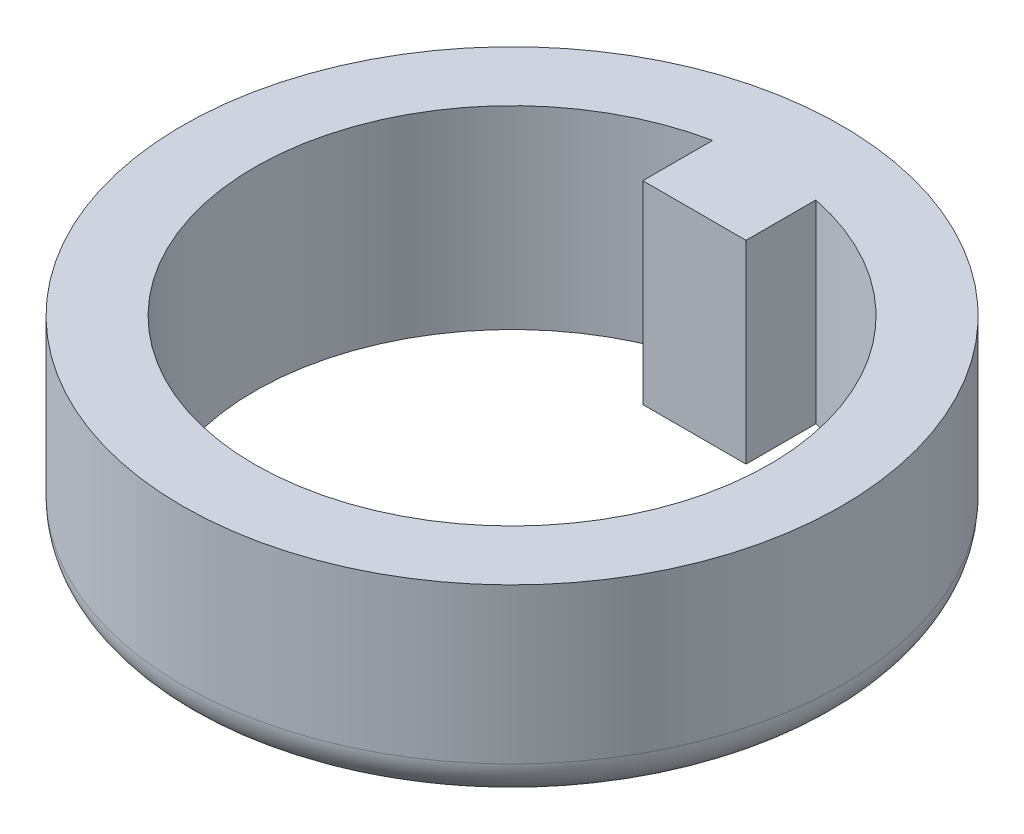
ISO-10303-21;
HEADER;
FILE_DESCRIPTION(('STEP AP214'),'2;1');
FILE_NAME('part.step','',(''),(''),'','','');
FILE_SCHEMA(('AUTOMOTIVE_DESIGN { 1 0 10303 214 1 1 1 1 }'));
ENDSEC;
DATA;
#1=APPLICATION_CONTEXT('core data for automotive mechanical design processes');
#2=APPLICATION_PROTOCOL_DEFINITION('international standard','automotive_design',2000,#1);
#3=PRODUCT_CONTEXT('',#1,'mechanical');
#4=PRODUCT('Part','Part','',(#3));
#5=PRODUCT_RELATED_PRODUCT_CATEGORY('part','',(#4));
#6=PRODUCT_DEFINITION_FORMATION('','',#4);
#7=PRODUCT_DEFINITION_CONTEXT('part definition',#1,'design');
#8=PRODUCT_DEFINITION('design','',#6,#7);
#9=PRODUCT_DEFINITION_SHAPE('','',#8);
#10=(LENGTH_UNIT() NAMED_UNIT(*) SI_UNIT(.MILLI.,.METRE.));
#11=(NAMED_UNIT(*) PLANE_ANGLE_UNIT() SI_UNIT($,.RADIAN.));
#12=(NAMED_UNIT(*) SI_UNIT($,.STERADIAN.) SOLID_ANGLE_UNIT());
#13=UNCERTAINTY_MEASURE_WITH_UNIT(LENGTH_MEASURE(1.E-05),#10,'distance_accuracy_value','');
#14=(GEOMETRIC_REPRESENTATION_CONTEXT(3) GLOBAL_UNCERTAINTY_ASSIGNED_CONTEXT((#13)) GLOBAL_UNIT_ASSIGNED_CONTEXT((#10,
#11,#12)) REPRESENTATION_CONTEXT('',''));
#15=CARTESIAN_POINT('',(0.,0.,0.));
#16=DIRECTION('',(0.,0.,1.));
#17=DIRECTION('',(1.,0.,0.));
#18=AXIS2_PLACEMENT_3D('',#15,#16,#17);
#19=CARTESIAN_POINT('',(0.,5.,0.));
#20=DIRECTION('',(0.,1.,0.));
#21=DIRECTION('',(0.,0.,1.));
#22=AXIS2_PLACEMENT_3D('',#19,#20,#21);
#23=PLANE('',#22);
#24=CARTESIAN_POINT('',(0.,5.,0.));
#25=DIRECTION('',(0.,1.,0.));
#26=DIRECTION('',(0.,0.,1.));
#27=AXIS2_PLACEMENT_3D('',#24,#25,#26);
#28=CIRCLE('',#27,8.5);
#29=CARTESIAN_POINT('',(0.,5.,8.5));
#30=VERTEX_POINT('',#29);
#31=EDGE_CURVE('E92',#30,#30,#28,.T.);
#32=ORIENTED_EDGE('',*,*,#31,.T.);
#33=EDGE_LOOP('',(#32));
#34=FACE_BOUND('',#33,.T.);
#35=DIRECTION('',(0.,0.,1.));
#36=VECTOR('',#35,1.);
#37=CARTESIAN_POINT('',(1.33,5.,-4.70400622693429));
#38=LINE('',#37,#36);
#39=CARTESIAN_POINT('',(1.33,5.,-6.50441550025827));
#40=VERTEX_POINT('',#39);
#41=CARTESIAN_POINT('',(1.33,5.,-4.70400622693429));
#42=VERTEX_POINT('',#41);
#43=EDGE_CURVE('E84',#40,#42,#38,.T.);
#44=ORIENTED_EDGE('',*,*,#43,.F.);
#45=CARTESIAN_POINT('',(0.,5.,0.));
#46=DIRECTION('',(0.,1.,0.));
#47=DIRECTION('',(0.,0.,1.));
#48=AXIS2_PLACEMENT_3D('',#45,#46,#47);
#49=CIRCLE('',#48,6.639);
#50=CARTESIAN_POINT('',(-1.332,5.,-6.50400622693429));
#51=VERTEX_POINT('',#50);
#52=EDGE_CURVE('E76',#51,#40,#49,.T.);
#53=ORIENTED_EDGE('',*,*,#52,.F.);
#54=DIRECTION('',(0.,0.,-1.));
#55=VECTOR('',#54,1.);
#56=CARTESIAN_POINT('',(-1.332,5.,-6.50400622693429));
#57=LINE('',#56,#55);
#58=CARTESIAN_POINT('',(-1.332,5.,-4.70400622693429));
#59=VERTEX_POINT('',#58);
#60=EDGE_CURVE('E98',#59,#51,#57,.T.);
#61=ORIENTED_EDGE('',*,*,#60,.F.);
#62=DIRECTION('',(-1.,0.,0.));
#63=VECTOR('',#62,1.);
#64=CARTESIAN_POINT('',(-1.332,5.,-4.70400622693429));
#65=LINE('',#64,#63);
#66=EDGE_CURVE('E96',#42,#59,#65,.T.);
#67=ORIENTED_EDGE('',*,*,#66,.F.);
#68=EDGE_LOOP('',(#44,#53,#61,#67));
#69=FACE_BOUND('',#68,.T.);
#70=ADVANCED_FACE('F35',(#34,#69),#23,.T.);
#71=CARTESIAN_POINT('',(0.,0.,0.));
#72=DIRECTION('',(0.,1.,0.));
#73=DIRECTION('',(0.,0.,1.));
#74=AXIS2_PLACEMENT_3D('',#71,#72,#73);
#75=PLANE('',#74);
#76=CARTESIAN_POINT('',(0.,0.,0.));
#77=DIRECTION('',(0.,1.,0.));
#78=DIRECTION('',(0.,0.,1.));
#79=AXIS2_PLACEMENT_3D('',#76,#77,#78);
#80=CIRCLE('',#79,7.5);
#81=CARTESIAN_POINT('',(0.,0.,7.5));
#82=VERTEX_POINT('',#81);
#83=EDGE_CURVE('E11',#82,#82,#80,.F.);
#84=ORIENTED_EDGE('',*,*,#83,.T.);
#85=EDGE_LOOP('',(#84));
#86=FACE_BOUND('',#85,.T.);
#87=CARTESIAN_POINT('',(0.,0.,0.));
#88=DIRECTION('',(0.,1.,0.));
#89=DIRECTION('',(0.,0.,1.));
#90=AXIS2_PLACEMENT_3D('',#87,#88,#89);
#91=CIRCLE('',#90,6.639);
#92=CARTESIAN_POINT('',(-1.332,0.,-6.50400622693429));
#93=VERTEX_POINT('',#92);
#94=CARTESIAN_POINT('',(1.33,0.,-6.50441550025827));
#95=VERTEX_POINT('',#94);
#96=EDGE_CURVE('E58',#93,#95,#91,.T.);
#97=ORIENTED_EDGE('',*,*,#96,.T.);
#98=DIRECTION('',(0.,0.,1.));
#99=VECTOR('',#98,1.);
#100=CARTESIAN_POINT('',(1.33,0.,-4.70400622693429));
#101=LINE('',#100,#99);
#102=CARTESIAN_POINT('',(1.33,0.,-4.70400622693429));
#103=VERTEX_POINT('',#102);
#104=EDGE_CURVE('E91',#95,#103,#101,.T.);
#105=ORIENTED_EDGE('',*,*,#104,.T.);
#106=DIRECTION('',(-1.,0.,0.));
#107=VECTOR('',#106,1.);
#108=CARTESIAN_POINT('',(-1.332,0.,-4.70400622693429));
#109=LINE('',#108,#107);
#110=CARTESIAN_POINT('',(-1.332,0.,-4.70400622693429));
#111=VERTEX_POINT('',#110);
#112=EDGE_CURVE('E104',#103,#111,#109,.T.);
#113=ORIENTED_EDGE('',*,*,#112,.T.);
#114=DIRECTION('',(0.,0.,-1.));
#115=VECTOR('',#114,1.);
#116=CARTESIAN_POINT('',(-1.332,0.,-6.50400622693429));
#117=LINE('',#116,#115);
#118=EDGE_CURVE('E85',#111,#93,#117,.T.);
#119=ORIENTED_EDGE('',*,*,#118,.T.);
#120=EDGE_LOOP('',(#97,#105,#113,#119));
#121=FACE_BOUND('',#120,.T.);
#122=ADVANCED_FACE('F129',(#86,#121),#75,.F.);
#123=CARTESIAN_POINT('',(0.,5.,0.));
#124=DIRECTION('',(0.,-1.,0.));
#125=DIRECTION('',(0.,0.,-1.));
#126=AXIS2_PLACEMENT_3D('',#123,#124,#125);
#127=CYLINDRICAL_SURFACE('',#126,8.5);
#128=CARTESIAN_POINT('',(0.,1.,0.));
#129=DIRECTION('',(0.,1.,0.));
#130=DIRECTION('',(0.,0.,1.));
#131=AXIS2_PLACEMENT_3D('',#128,#129,#130);
#132=CIRCLE('',#131,8.5);
#133=CARTESIAN_POINT('',(0.,1.,8.5));
#134=VERTEX_POINT('',#133);
#135=EDGE_CURVE('E43',#134,#134,#132,.T.);
#136=ORIENTED_EDGE('',*,*,#135,.T.);
#137=EDGE_LOOP('',(#136));
#138=FACE_BOUND('',#137,.T.);
#139=ORIENTED_EDGE('',*,*,#31,.F.);
#140=EDGE_LOOP('',(#139));
#141=FACE_BOUND('',#140,.T.);
#142=ADVANCED_FACE('F116',(#138,#141),#127,.T.);
#143=CARTESIAN_POINT('',(0.,5.,0.));
#144=DIRECTION('',(0.,-1.,0.));
#145=DIRECTION('',(0.,0.,-1.));
#146=AXIS2_PLACEMENT_3D('',#143,#144,#145);
#147=CYLINDRICAL_SURFACE('',#146,6.639);
#148=ORIENTED_EDGE('',*,*,#96,.F.);
#149=DIRECTION('',(0.,-1.,0.));
#150=VECTOR('',#149,1.);
#151=CARTESIAN_POINT('',(-1.332,5.,-6.50400622693429));
#152=LINE('',#151,#150);
#153=EDGE_CURVE('E80',#51,#93,#152,.T.);
#154=ORIENTED_EDGE('',*,*,#153,.F.);
#155=ORIENTED_EDGE('',*,*,#52,.T.);
#156=DIRECTION('',(0.,-1.,0.));
#157=VECTOR('',#156,1.);
#158=CARTESIAN_POINT('',(1.33,5.,-6.50441550025827));
#159=LINE('',#158,#157);
#160=EDGE_CURVE('E79',#40,#95,#159,.T.);
#161=ORIENTED_EDGE('',*,*,#160,.T.);
#162=EDGE_LOOP('',(#148,#154,#155,#161));
#163=FACE_BOUND('',#162,.T.);
#164=ADVANCED_FACE('F78',(#163),#147,.F.);
#165=CARTESIAN_POINT('',(1.33,5.,-4.70400622693429));
#166=DIRECTION('',(1.,0.,0.));
#167=DIRECTION('',(0.,0.,-1.));
#168=AXIS2_PLACEMENT_3D('',#165,#166,#167);
#169=PLANE('',#168);
#170=ORIENTED_EDGE('',*,*,#104,.F.);
#171=ORIENTED_EDGE('',*,*,#160,.F.);
#172=ORIENTED_EDGE('',*,*,#43,.T.);
#173=DIRECTION('',(0.,-1.,0.));
#174=VECTOR('',#173,1.);
#175=CARTESIAN_POINT('',(1.33,5.,-4.70400622693429));
#176=LINE('',#175,#174);
#177=EDGE_CURVE('E93',#42,#103,#176,.T.);
#178=ORIENTED_EDGE('',*,*,#177,.T.);
#179=EDGE_LOOP('',(#170,#171,#172,#178));
#180=FACE_BOUND('',#179,.T.);
#181=ADVANCED_FACE('F88',(#180),#169,.T.);
#182=CARTESIAN_POINT('',(-1.332,5.,-4.70400622693429));
#183=DIRECTION('',(0.,0.,1.));
#184=DIRECTION('',(1.,0.,0.));
#185=AXIS2_PLACEMENT_3D('',#182,#183,#184);
#186=PLANE('',#185);
#187=ORIENTED_EDGE('',*,*,#112,.F.);
#188=ORIENTED_EDGE('',*,*,#177,.F.);
#189=ORIENTED_EDGE('',*,*,#66,.T.);
#190=DIRECTION('',(0.,-1.,0.));
#191=VECTOR('',#190,1.);
#192=CARTESIAN_POINT('',(-1.332,5.,-4.70400622693429));
#193=LINE('',#192,#191);
#194=EDGE_CURVE('E50',#59,#111,#193,.T.);
#195=ORIENTED_EDGE('',*,*,#194,.T.);
#196=EDGE_LOOP('',(#187,#188,#189,#195));
#197=FACE_BOUND('',#196,.T.);
#198=ADVANCED_FACE('F125',(#197),#186,.T.);
#199=CARTESIAN_POINT('',(-1.332,5.,-6.50400622693429));
#200=DIRECTION('',(-1.,0.,0.));
#201=DIRECTION('',(0.,0.,1.));
#202=AXIS2_PLACEMENT_3D('',#199,#200,#201);
#203=PLANE('',#202);
#204=ORIENTED_EDGE('',*,*,#118,.F.);
#205=ORIENTED_EDGE('',*,*,#194,.F.);
#206=ORIENTED_EDGE('',*,*,#60,.T.);
#207=ORIENTED_EDGE('',*,*,#153,.T.);
#208=EDGE_LOOP('',(#204,#205,#206,#207));
#209=FACE_BOUND('',#208,.T.);
#210=ADVANCED_FACE('F120',(#209),#203,.T.);
#211=CARTESIAN_POINT('',(0.,1.,0.));
#212=DIRECTION('',(0.,1.,0.));
#213=DIRECTION('',(0.,0.,1.));
#214=AXIS2_PLACEMENT_3D('',#211,#212,#213);
#215=TOROIDAL_SURFACE('',#214,7.5,1.);
#216=ORIENTED_EDGE('',*,*,#83,.F.);
#217=EDGE_LOOP('',(#216));
#218=FACE_BOUND('',#217,.T.);
#219=ORIENTED_EDGE('',*,*,#135,.F.);
#220=EDGE_LOOP('',(#219));
#221=FACE_BOUND('',#220,.T.);
#222=ADVANCED_FACE('F37',(#218,#221),#215,.T.);
#223=CLOSED_SHELL('',(#70,#122,#142,#164,#181,#198,#210,#222));
#224=MANIFOLD_SOLID_BREP('B2',#223);
#225=ADVANCED_BREP_SHAPE_REPRESENTATION('',(#18,#224),#14);
#226=SHAPE_DEFINITION_REPRESENTATION(#9,#225);
ENDSEC;
END-ISO-10303-21;
